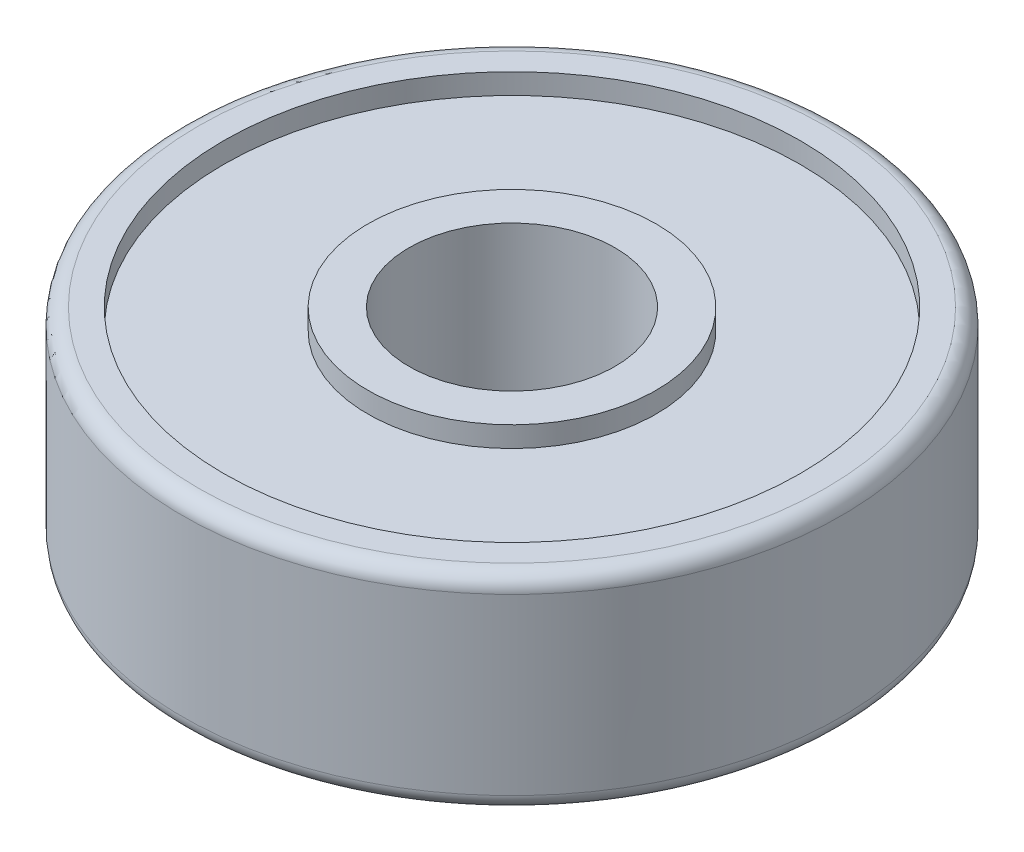
ISO-10303-21;
HEADER;
FILE_DESCRIPTION(('STEP AP214'),'2;1');
FILE_NAME('part.step','',(''),(''),'','','');
FILE_SCHEMA(('AUTOMOTIVE_DESIGN { 1 0 10303 214 1 1 1 1 }'));
ENDSEC;
DATA;
#1=APPLICATION_CONTEXT('core data for automotive mechanical design processes');
#2=APPLICATION_PROTOCOL_DEFINITION('international standard','automotive_design',2000,#1);
#3=PRODUCT_CONTEXT('',#1,'mechanical');
#4=PRODUCT('Part','Part','',(#3));
#5=PRODUCT_RELATED_PRODUCT_CATEGORY('part','',(#4));
#6=PRODUCT_DEFINITION_FORMATION('','',#4);
#7=PRODUCT_DEFINITION_CONTEXT('part definition',#1,'design');
#8=PRODUCT_DEFINITION('design','',#6,#7);
#9=PRODUCT_DEFINITION_SHAPE('','',#8);
#10=(LENGTH_UNIT() NAMED_UNIT(*) SI_UNIT(.MILLI.,.METRE.));
#11=(NAMED_UNIT(*) PLANE_ANGLE_UNIT() SI_UNIT($,.RADIAN.));
#12=(NAMED_UNIT(*) SI_UNIT($,.STERADIAN.) SOLID_ANGLE_UNIT());
#13=UNCERTAINTY_MEASURE_WITH_UNIT(LENGTH_MEASURE(1.E-05),#10,'distance_accuracy_value','');
#14=(GEOMETRIC_REPRESENTATION_CONTEXT(3) GLOBAL_UNCERTAINTY_ASSIGNED_CONTEXT((#13)) GLOBAL_UNIT_ASSIGNED_CONTEXT((#10,
#11,#12)) REPRESENTATION_CONTEXT('',''));
#15=CARTESIAN_POINT('',(0.,0.,0.));
#16=DIRECTION('',(0.,0.,1.));
#17=DIRECTION('',(1.,0.,0.));
#18=AXIS2_PLACEMENT_3D('',#15,#16,#17);
#19=CARTESIAN_POINT('',(0.,2.75,0.));
#20=DIRECTION('',(0.,-1.,0.));
#21=DIRECTION('',(0.,0.,-1.));
#22=AXIS2_PLACEMENT_3D('',#19,#20,#21);
#23=CYLINDRICAL_SURFACE('',#22,7.);
#24=CARTESIAN_POINT('',(0.,2.5,0.));
#25=DIRECTION('',(0.,-1.,0.));
#26=DIRECTION('',(0.,0.,-1.));
#27=AXIS2_PLACEMENT_3D('',#24,#25,#26);
#28=CIRCLE('',#27,7.);
#29=CARTESIAN_POINT('',(0.,2.5,-7.));
#30=VERTEX_POINT('',#29);
#31=EDGE_CURVE('E184',#30,#30,#28,.F.);
#32=ORIENTED_EDGE('',*,*,#31,.T.);
#33=EDGE_LOOP('',(#32));
#34=FACE_BOUND('',#33,.T.);
#35=CARTESIAN_POINT('',(0.,2.,0.));
#36=DIRECTION('',(0.,-1.,0.));
#37=DIRECTION('',(0.,0.,-1.));
#38=AXIS2_PLACEMENT_3D('',#35,#36,#37);
#39=CIRCLE('',#38,7.);
#40=CARTESIAN_POINT('',(0.,2.,-7.));
#41=VERTEX_POINT('',#40);
#42=EDGE_CURVE('E60',#41,#41,#39,.T.);
#43=ORIENTED_EDGE('',*,*,#42,.T.);
#44=EDGE_LOOP('',(#43));
#45=FACE_BOUND('',#44,.T.);
#46=ADVANCED_FACE('F18',(#34,#45),#23,.F.);
#47=CARTESIAN_POINT('',(0.,2.5,0.));
#48=DIRECTION('',(0.,-1.,0.));
#49=DIRECTION('',(0.,0.,-1.));
#50=AXIS2_PLACEMENT_3D('',#47,#48,#49);
#51=PLANE('',#50);
#52=ORIENTED_EDGE('',*,*,#31,.F.);
#53=EDGE_LOOP('',(#52));
#54=FACE_BOUND('',#53,.T.);
#55=CARTESIAN_POINT('',(0.,2.5,0.));
#56=DIRECTION('',(0.,-1.,0.));
#57=DIRECTION('',(1.,0.,0.));
#58=AXIS2_PLACEMENT_3D('',#55,#56,#57);
#59=CIRCLE('',#58,7.615);
#60=CARTESIAN_POINT('',(7.615,2.5,0.));
#61=VERTEX_POINT('',#60);
#62=CARTESIAN_POINT('',(-7.615,2.5,0.));
#63=VERTEX_POINT('',#62);
#64=EDGE_CURVE('E57',#61,#63,#59,.T.);
#65=ORIENTED_EDGE('',*,*,#64,.F.);
#66=CARTESIAN_POINT('',(0.,2.5,0.));
#67=DIRECTION('',(0.,-1.,0.));
#68=DIRECTION('',(-1.,0.,0.));
#69=AXIS2_PLACEMENT_3D('',#66,#67,#68);
#70=CIRCLE('',#69,7.615);
#71=EDGE_CURVE('E52',#63,#61,#70,.T.);
#72=ORIENTED_EDGE('',*,*,#71,.F.);
#73=EDGE_LOOP('',(#65,#72));
#74=FACE_BOUND('',#73,.T.);
#75=ADVANCED_FACE('F56',(#54,#74),#51,.F.);
#76=CARTESIAN_POINT('',(0.,2.,0.));
#77=DIRECTION('',(0.,-1.,0.));
#78=DIRECTION('',(0.,0.,-1.));
#79=AXIS2_PLACEMENT_3D('',#76,#77,#78);
#80=PLANE('',#79);
#81=CARTESIAN_POINT('',(0.,2.,0.));
#82=DIRECTION('',(0.,-1.,0.));
#83=DIRECTION('',(0.,0.,-1.));
#84=AXIS2_PLACEMENT_3D('',#81,#82,#83);
#85=CIRCLE('',#84,3.5);
#86=CARTESIAN_POINT('',(0.,2.,-3.5));
#87=VERTEX_POINT('',#86);
#88=EDGE_CURVE('E66',#87,#87,#85,.F.);
#89=ORIENTED_EDGE('',*,*,#88,.F.);
#90=EDGE_LOOP('',(#89));
#91=FACE_BOUND('',#90,.T.);
#92=ORIENTED_EDGE('',*,*,#42,.F.);
#93=EDGE_LOOP('',(#92));
#94=FACE_BOUND('',#93,.T.);
#95=ADVANCED_FACE('F84',(#91,#94),#80,.F.);
#96=CARTESIAN_POINT('',(0.,2.115,0.));
#97=DIRECTION('',(0.,-1.,0.));
#98=DIRECTION('',(-0.999979984034064,0.,-0.00632704759221277));
#99=AXIS2_PLACEMENT_3D('',#96,#97,#98);
#100=TOROIDAL_SURFACE('',#99,7.615,0.385);
#101=CARTESIAN_POINT('',(0.,2.115,0.));
#102=DIRECTION('',(0.,-1.,0.));
#103=DIRECTION('',(0.,0.,-1.));
#104=AXIS2_PLACEMENT_3D('',#101,#102,#103);
#105=CIRCLE('',#104,8.);
#106=CARTESIAN_POINT('',(0.,2.115,-8.));
#107=VERTEX_POINT('',#106);
#108=EDGE_CURVE('E93',#107,#107,#105,.T.);
#109=ORIENTED_EDGE('',*,*,#108,.F.);
#110=EDGE_LOOP('',(#109));
#111=FACE_BOUND('',#110,.T.);
#112=ORIENTED_EDGE('',*,*,#64,.T.);
#113=ORIENTED_EDGE('',*,*,#71,.T.);
#114=EDGE_LOOP('',(#112,#113));
#115=FACE_BOUND('',#114,.T.);
#116=ADVANCED_FACE('F64',(#111,#115),#100,.T.);
#117=CARTESIAN_POINT('',(0.,2.75,0.));
#118=DIRECTION('',(0.,-1.,0.));
#119=DIRECTION('',(0.,0.,-1.));
#120=AXIS2_PLACEMENT_3D('',#117,#118,#119);
#121=CYLINDRICAL_SURFACE('',#120,3.5);
#122=ORIENTED_EDGE('',*,*,#88,.T.);
#123=EDGE_LOOP('',(#122));
#124=FACE_BOUND('',#123,.T.);
#125=CARTESIAN_POINT('',(0.,2.5,0.));
#126=DIRECTION('',(0.,-1.,0.));
#127=DIRECTION('',(0.,0.,-1.));
#128=AXIS2_PLACEMENT_3D('',#125,#126,#127);
#129=CIRCLE('',#128,3.5);
#130=CARTESIAN_POINT('',(0.,2.5,-3.5));
#131=VERTEX_POINT('',#130);
#132=EDGE_CURVE('E96',#131,#131,#129,.T.);
#133=ORIENTED_EDGE('',*,*,#132,.T.);
#134=EDGE_LOOP('',(#133));
#135=FACE_BOUND('',#134,.T.);
#136=ADVANCED_FACE('F83',(#124,#135),#121,.T.);
#137=CARTESIAN_POINT('',(0.,2.75,0.));
#138=DIRECTION('',(0.,-1.,0.));
#139=DIRECTION('',(0.,0.,-1.));
#140=AXIS2_PLACEMENT_3D('',#137,#138,#139);
#141=CYLINDRICAL_SURFACE('',#140,8.);
#142=CARTESIAN_POINT('',(0.,-2.115,0.));
#143=DIRECTION('',(0.,-1.,0.));
#144=DIRECTION('',(-0.99999082970482,0.,-0.00428258172899209));
#145=AXIS2_PLACEMENT_3D('',#142,#143,#144);
#146=CIRCLE('',#145,8.);
#147=CARTESIAN_POINT('',(-7.99992663763856,-2.115,-0.0342606538319367));
#148=VERTEX_POINT('',#147);
#149=EDGE_CURVE('E91',#148,#148,#146,.T.);
#150=ORIENTED_EDGE('',*,*,#149,.F.);
#151=EDGE_LOOP('',(#150));
#152=FACE_BOUND('',#151,.T.);
#153=ORIENTED_EDGE('',*,*,#108,.T.);
#154=EDGE_LOOP('',(#153));
#155=FACE_BOUND('',#154,.T.);
#156=ADVANCED_FACE('F229',(#152,#155),#141,.T.);
#157=CARTESIAN_POINT('',(0.,2.5,0.));
#158=DIRECTION('',(0.,-1.,0.));
#159=DIRECTION('',(0.,0.,-1.));
#160=AXIS2_PLACEMENT_3D('',#157,#158,#159);
#161=PLANE('',#160);
#162=CARTESIAN_POINT('',(0.,2.5,0.));
#163=DIRECTION('',(0.,-1.,0.));
#164=DIRECTION('',(0.,0.,-1.));
#165=AXIS2_PLACEMENT_3D('',#162,#163,#164);
#166=CIRCLE('',#165,2.5);
#167=CARTESIAN_POINT('',(0.,2.5,-2.5));
#168=VERTEX_POINT('',#167);
#169=EDGE_CURVE('E197',#168,#168,#166,.T.);
#170=ORIENTED_EDGE('',*,*,#169,.T.);
#171=EDGE_LOOP('',(#170));
#172=FACE_BOUND('',#171,.T.);
#173=ORIENTED_EDGE('',*,*,#132,.F.);
#174=EDGE_LOOP('',(#173));
#175=FACE_BOUND('',#174,.T.);
#176=ADVANCED_FACE('F169',(#172,#175),#161,.F.);
#177=CARTESIAN_POINT('',(0.,-2.115,0.));
#178=DIRECTION('',(0.,-1.,0.));
#179=DIRECTION('',(-0.99999082970482,0.,-0.00428258172899209));
#180=AXIS2_PLACEMENT_3D('',#177,#178,#179);
#181=TOROIDAL_SURFACE('',#180,7.615,0.385);
#182=CARTESIAN_POINT('',(0.,-2.5,0.));
#183=DIRECTION('',(0.,1.,0.));
#184=DIRECTION('',(1.,0.,0.));
#185=AXIS2_PLACEMENT_3D('',#182,#183,#184);
#186=CIRCLE('',#185,7.615);
#187=CARTESIAN_POINT('',(-7.615,-2.5,0.));
#188=VERTEX_POINT('',#187);
#189=CARTESIAN_POINT('',(7.615,-2.5,0.));
#190=VERTEX_POINT('',#189);
#191=EDGE_CURVE('E183',#188,#190,#186,.F.);
#192=ORIENTED_EDGE('',*,*,#191,.F.);
#193=CARTESIAN_POINT('',(0.,-2.5,0.));
#194=DIRECTION('',(0.,1.,0.));
#195=DIRECTION('',(-1.,0.,0.));
#196=AXIS2_PLACEMENT_3D('',#193,#194,#195);
#197=CIRCLE('',#196,7.615);
#198=EDGE_CURVE('E42',#190,#188,#197,.F.);
#199=ORIENTED_EDGE('',*,*,#198,.F.);
#200=EDGE_LOOP('',(#192,#199));
#201=FACE_BOUND('',#200,.T.);
#202=ORIENTED_EDGE('',*,*,#149,.T.);
#203=EDGE_LOOP('',(#202));
#204=FACE_BOUND('',#203,.T.);
#205=ADVANCED_FACE('F165',(#201,#204),#181,.T.);
#206=CARTESIAN_POINT('',(0.,2.75,0.));
#207=DIRECTION('',(0.,-1.,0.));
#208=DIRECTION('',(0.,0.,-1.));
#209=AXIS2_PLACEMENT_3D('',#206,#207,#208);
#210=CYLINDRICAL_SURFACE('',#209,2.5);
#211=CARTESIAN_POINT('',(0.,-2.5,0.));
#212=DIRECTION('',(0.,-1.,0.));
#213=DIRECTION('',(0.,0.,-1.));
#214=AXIS2_PLACEMENT_3D('',#211,#212,#213);
#215=CIRCLE('',#214,2.5);
#216=CARTESIAN_POINT('',(0.,-2.5,-2.5));
#217=VERTEX_POINT('',#216);
#218=EDGE_CURVE('E201',#217,#217,#215,.F.);
#219=ORIENTED_EDGE('',*,*,#218,.F.);
#220=EDGE_LOOP('',(#219));
#221=FACE_BOUND('',#220,.T.);
#222=ORIENTED_EDGE('',*,*,#169,.F.);
#223=EDGE_LOOP('',(#222));
#224=FACE_BOUND('',#223,.T.);
#225=ADVANCED_FACE('F146',(#221,#224),#210,.F.);
#226=CARTESIAN_POINT('',(0.,-2.5,0.));
#227=DIRECTION('',(0.,-1.,0.));
#228=DIRECTION('',(0.,0.,-1.));
#229=AXIS2_PLACEMENT_3D('',#226,#227,#228);
#230=PLANE('',#229);
#231=CARTESIAN_POINT('',(0.,-2.5,0.));
#232=DIRECTION('',(0.,-1.,0.));
#233=DIRECTION('',(0.,0.,-1.));
#234=AXIS2_PLACEMENT_3D('',#231,#232,#233);
#235=CIRCLE('',#234,7.);
#236=CARTESIAN_POINT('',(0.,-2.5,-7.));
#237=VERTEX_POINT('',#236);
#238=EDGE_CURVE('E205',#237,#237,#235,.F.);
#239=ORIENTED_EDGE('',*,*,#238,.T.);
#240=EDGE_LOOP('',(#239));
#241=FACE_BOUND('',#240,.T.);
#242=ORIENTED_EDGE('',*,*,#191,.T.);
#243=ORIENTED_EDGE('',*,*,#198,.T.);
#244=EDGE_LOOP('',(#242,#243));
#245=FACE_BOUND('',#244,.T.);
#246=ADVANCED_FACE('F141',(#241,#245),#230,.T.);
#247=CARTESIAN_POINT('',(0.,-2.5,0.));
#248=DIRECTION('',(0.,-1.,0.));
#249=DIRECTION('',(0.,0.,-1.));
#250=AXIS2_PLACEMENT_3D('',#247,#248,#249);
#251=PLANE('',#250);
#252=ORIENTED_EDGE('',*,*,#218,.T.);
#253=EDGE_LOOP('',(#252));
#254=FACE_BOUND('',#253,.T.);
#255=CARTESIAN_POINT('',(0.,-2.5,0.));
#256=DIRECTION('',(0.,-1.,0.));
#257=DIRECTION('',(0.,0.,-1.));
#258=AXIS2_PLACEMENT_3D('',#255,#256,#257);
#259=CIRCLE('',#258,3.5);
#260=CARTESIAN_POINT('',(0.,-2.5,-3.5));
#261=VERTEX_POINT('',#260);
#262=EDGE_CURVE('E209',#261,#261,#259,.F.);
#263=ORIENTED_EDGE('',*,*,#262,.F.);
#264=EDGE_LOOP('',(#263));
#265=FACE_BOUND('',#264,.T.);
#266=ADVANCED_FACE('F137',(#254,#265),#251,.T.);
#267=CARTESIAN_POINT('',(0.,2.75,0.));
#268=DIRECTION('',(0.,-1.,0.));
#269=DIRECTION('',(0.,0.,-1.));
#270=AXIS2_PLACEMENT_3D('',#267,#268,#269);
#271=CYLINDRICAL_SURFACE('',#270,7.);
#272=CARTESIAN_POINT('',(0.,-2.,0.));
#273=DIRECTION('',(0.,-1.,0.));
#274=DIRECTION('',(0.,0.,-1.));
#275=AXIS2_PLACEMENT_3D('',#272,#273,#274);
#276=CIRCLE('',#275,7.);
#277=CARTESIAN_POINT('',(0.,-2.,-7.));
#278=VERTEX_POINT('',#277);
#279=EDGE_CURVE('E30',#278,#278,#276,.T.);
#280=ORIENTED_EDGE('',*,*,#279,.F.);
#281=EDGE_LOOP('',(#280));
#282=FACE_BOUND('',#281,.T.);
#283=ORIENTED_EDGE('',*,*,#238,.F.);
#284=EDGE_LOOP('',(#283));
#285=FACE_BOUND('',#284,.T.);
#286=ADVANCED_FACE('F127',(#282,#285),#271,.F.);
#287=CARTESIAN_POINT('',(0.,2.75,0.));
#288=DIRECTION('',(0.,-1.,0.));
#289=DIRECTION('',(0.,0.,-1.));
#290=AXIS2_PLACEMENT_3D('',#287,#288,#289);
#291=CYLINDRICAL_SURFACE('',#290,3.5);
#292=CARTESIAN_POINT('',(0.,-2.,0.));
#293=DIRECTION('',(0.,-1.,0.));
#294=DIRECTION('',(0.,0.,-1.));
#295=AXIS2_PLACEMENT_3D('',#292,#293,#294);
#296=CIRCLE('',#295,3.5);
#297=CARTESIAN_POINT('',(0.,-2.,-3.5));
#298=VERTEX_POINT('',#297);
#299=EDGE_CURVE('E11',#298,#298,#296,.F.);
#300=ORIENTED_EDGE('',*,*,#299,.F.);
#301=EDGE_LOOP('',(#300));
#302=FACE_BOUND('',#301,.T.);
#303=ORIENTED_EDGE('',*,*,#262,.T.);
#304=EDGE_LOOP('',(#303));
#305=FACE_BOUND('',#304,.T.);
#306=ADVANCED_FACE('F120',(#302,#305),#291,.T.);
#307=CARTESIAN_POINT('',(0.,-2.,0.));
#308=DIRECTION('',(0.,-1.,0.));
#309=DIRECTION('',(0.,0.,-1.));
#310=AXIS2_PLACEMENT_3D('',#307,#308,#309);
#311=PLANE('',#310);
#312=ORIENTED_EDGE('',*,*,#299,.T.);
#313=EDGE_LOOP('',(#312));
#314=FACE_BOUND('',#313,.T.);
#315=ORIENTED_EDGE('',*,*,#279,.T.);
#316=EDGE_LOOP('',(#315));
#317=FACE_BOUND('',#316,.T.);
#318=ADVANCED_FACE('F118',(#314,#317),#311,.T.);
#319=CLOSED_SHELL('',(#46,#75,#95,#116,#136,#156,#176,#205,#225,#246,#266,#286,#306,#318));
#320=CARTESIAN_POINT('',(0.,0.,0.));
#321=DIRECTION('',(0.,-1.,0.));
#322=DIRECTION('',(0.,0.,1.));
#323=AXIS2_PLACEMENT_3D('',#320,#321,#322);
#324=TOROIDAL_SURFACE('',#323,5.2,1.75);
#325=ADVANCED_FACE('F132',(),#324,.F.);
#326=CLOSED_SHELL('',(#325));
#327=ORIENTED_CLOSED_SHELL('',*,#326,.T.);
#328=BREP_WITH_VOIDS('B1',#319,(#327));
#329=ADVANCED_BREP_SHAPE_REPRESENTATION('',(#18,#328),#14);
#330=SHAPE_DEFINITION_REPRESENTATION(#9,#329);
ENDSEC;
END-ISO-10303-21;
